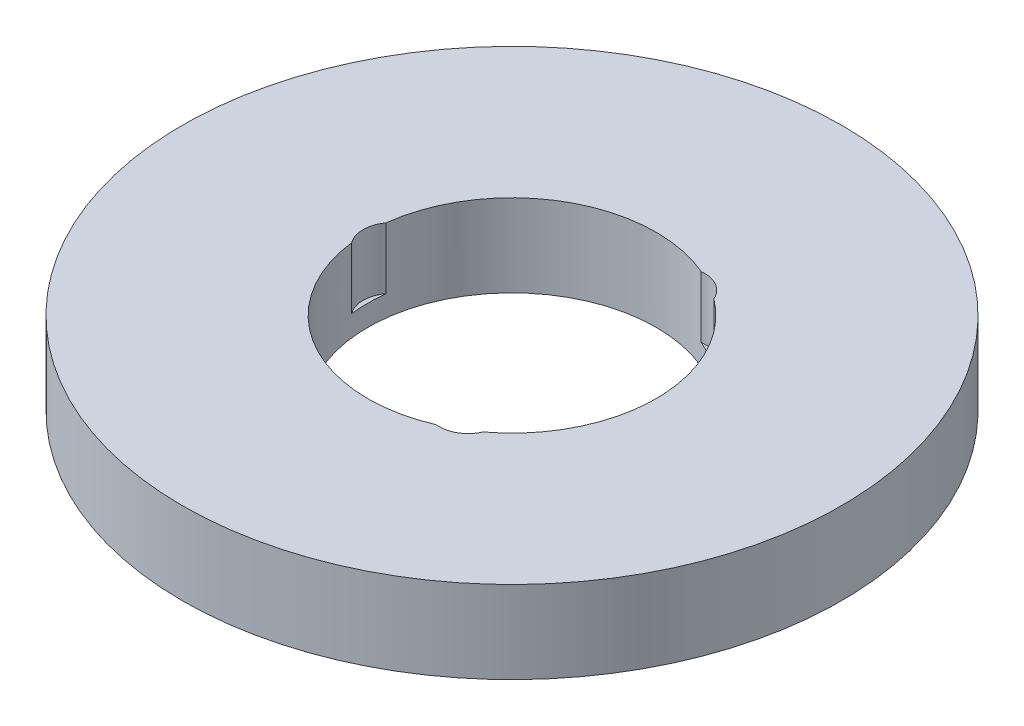
ISO-10303-21;
HEADER;
FILE_DESCRIPTION(('STEP AP214'),'2;1');
FILE_NAME('part.step','',(''),(''),'','','');
FILE_SCHEMA(('AUTOMOTIVE_DESIGN { 1 0 10303 214 1 1 1 1 }'));
ENDSEC;
DATA;
#1=APPLICATION_CONTEXT('core data for automotive mechanical design processes');
#2=APPLICATION_PROTOCOL_DEFINITION('international standard','automotive_design',2000,#1);
#3=PRODUCT_CONTEXT('',#1,'mechanical');
#4=PRODUCT('Part','Part','',(#3));
#5=PRODUCT_RELATED_PRODUCT_CATEGORY('part','',(#4));
#6=PRODUCT_DEFINITION_FORMATION('','',#4);
#7=PRODUCT_DEFINITION_CONTEXT('part definition',#1,'design');
#8=PRODUCT_DEFINITION('design','',#6,#7);
#9=PRODUCT_DEFINITION_SHAPE('','',#8);
#10=(LENGTH_UNIT() NAMED_UNIT(*) SI_UNIT(.MILLI.,.METRE.));
#11=(NAMED_UNIT(*) PLANE_ANGLE_UNIT() SI_UNIT($,.RADIAN.));
#12=(NAMED_UNIT(*) SI_UNIT($,.STERADIAN.) SOLID_ANGLE_UNIT());
#13=UNCERTAINTY_MEASURE_WITH_UNIT(LENGTH_MEASURE(1.E-05),#10,'distance_accuracy_value','');
#14=(GEOMETRIC_REPRESENTATION_CONTEXT(3) GLOBAL_UNCERTAINTY_ASSIGNED_CONTEXT((#13)) GLOBAL_UNIT_ASSIGNED_CONTEXT((#10,
#11,#12)) REPRESENTATION_CONTEXT('',''));
#15=CARTESIAN_POINT('',(0.,0.,0.));
#16=DIRECTION('',(0.,0.,1.));
#17=DIRECTION('',(1.,0.,0.));
#18=AXIS2_PLACEMENT_3D('',#15,#16,#17);
#19=CARTESIAN_POINT('',(0.,10.,0.));
#20=DIRECTION('',(0.,-1.,0.));
#21=DIRECTION('',(0.,0.,-1.));
#22=AXIS2_PLACEMENT_3D('',#19,#20,#21);
#23=CYLINDRICAL_SURFACE('',#22,40.);
#24=CARTESIAN_POINT('',(0.,10.,0.));
#25=DIRECTION('',(0.,1.,0.));
#26=DIRECTION('',(0.,0.,1.));
#27=AXIS2_PLACEMENT_3D('',#24,#25,#26);
#28=CIRCLE('',#27,40.);
#29=CARTESIAN_POINT('',(0.,10.,40.));
#30=VERTEX_POINT('',#29);
#31=EDGE_CURVE('E130',#30,#30,#28,.T.);
#32=ORIENTED_EDGE('',*,*,#31,.F.);
#33=EDGE_LOOP('',(#32));
#34=FACE_BOUND('',#33,.T.);
#35=CARTESIAN_POINT('',(0.,0.,0.));
#36=DIRECTION('',(0.,1.,0.));
#37=DIRECTION('',(0.,0.,1.));
#38=AXIS2_PLACEMENT_3D('',#35,#36,#37);
#39=CIRCLE('',#38,40.);
#40=CARTESIAN_POINT('',(0.,0.,40.));
#41=VERTEX_POINT('',#40);
#42=EDGE_CURVE('E117',#41,#41,#39,.T.);
#43=ORIENTED_EDGE('',*,*,#42,.T.);
#44=EDGE_LOOP('',(#43));
#45=FACE_BOUND('',#44,.T.);
#46=ADVANCED_FACE('F39',(#34,#45),#23,.T.);
#47=CARTESIAN_POINT('',(0.,10.,0.));
#48=DIRECTION('',(0.,1.,0.));
#49=DIRECTION('',(0.,0.,1.));
#50=AXIS2_PLACEMENT_3D('',#47,#48,#49);
#51=PLANE('',#50);
#52=CARTESIAN_POINT('',(7.26421371116821,10.,12.5819872247817));
#53=DIRECTION('',(0.,1.,0.));
#54=DIRECTION('',(0.866025403784436,0.,-0.500000000000004));
#55=AXIS2_PLACEMENT_3D('',#52,#53,#54);
#56=CIRCLE('',#55,3.53103083995547);
#57=CARTESIAN_POINT('',(6.87777020104384,10.,16.0918077623875));
#58=VERTEX_POINT('',#57);
#59=CARTESIAN_POINT('',(10.4970292145214,10.,14.0022275966892));
#60=VERTEX_POINT('',#59);
#61=EDGE_CURVE('E148',#58,#60,#56,.T.);
#62=ORIENTED_EDGE('',*,*,#61,.F.);
#63=CARTESIAN_POINT('',(0.,10.,0.));
#64=DIRECTION('',(0.,1.,0.));
#65=DIRECTION('',(0.,0.,1.));
#66=AXIS2_PLACEMENT_3D('',#63,#64,#65);
#67=CIRCLE('',#66,17.5);
#68=CARTESIAN_POINT('',(-17.3747994155651,10.,2.08958016569824));
#69=VERTEX_POINT('',#68);
#70=EDGE_CURVE('E113',#69,#58,#67,.T.);
#71=ORIENTED_EDGE('',*,*,#70,.F.);
#72=CARTESIAN_POINT('',(-14.5284274223363,10.,0.));
#73=DIRECTION('',(0.,1.,0.));
#74=DIRECTION('',(0.,0.,1.));
#75=AXIS2_PLACEMENT_3D('',#72,#73,#74);
#76=CIRCLE('',#75,3.53103083995547);
#77=CARTESIAN_POINT('',(-17.3747994155651,10.,-2.08958016569824));
#78=VERTEX_POINT('',#77);
#79=EDGE_CURVE('E125',#78,#69,#76,.T.);
#80=ORIENTED_EDGE('',*,*,#79,.F.);
#81=CARTESIAN_POINT('',(6.87777020104362,10.,-16.0918077623876));
#82=VERTEX_POINT('',#81);
#83=EDGE_CURVE('E107',#82,#78,#67,.T.);
#84=ORIENTED_EDGE('',*,*,#83,.F.);
#85=CARTESIAN_POINT('',(7.26421371116804,10.,-12.5819872247818));
#86=DIRECTION('',(0.,1.,0.));
#87=DIRECTION('',(-0.866025403784443,0.,-0.499999999999992));
#88=AXIS2_PLACEMENT_3D('',#85,#86,#87);
#89=CIRCLE('',#88,3.53103083995547);
#90=CARTESIAN_POINT('',(10.4970292145212,10.,-14.0022275966894));
#91=VERTEX_POINT('',#90);
#92=EDGE_CURVE('E95',#91,#82,#89,.T.);
#93=ORIENTED_EDGE('',*,*,#92,.F.);
#94=EDGE_CURVE('E106',#60,#91,#67,.T.);
#95=ORIENTED_EDGE('',*,*,#94,.F.);
#96=EDGE_LOOP('',(#62,#71,#80,#84,#93,#95));
#97=FACE_BOUND('',#96,.T.);
#98=ORIENTED_EDGE('',*,*,#31,.T.);
#99=EDGE_LOOP('',(#98));
#100=FACE_BOUND('',#99,.T.);
#101=ADVANCED_FACE('F102',(#97,#100),#51,.T.);
#102=CARTESIAN_POINT('',(0.,0.,0.));
#103=DIRECTION('',(0.,1.,0.));
#104=DIRECTION('',(0.,0.,1.));
#105=AXIS2_PLACEMENT_3D('',#102,#103,#104);
#106=PLANE('',#105);
#107=CARTESIAN_POINT('',(0.,0.,0.));
#108=DIRECTION('',(0.,1.,0.));
#109=DIRECTION('',(0.,0.,1.));
#110=AXIS2_PLACEMENT_3D('',#107,#108,#109);
#111=CIRCLE('',#110,17.5);
#112=CARTESIAN_POINT('',(0.,0.,17.5));
#113=VERTEX_POINT('',#112);
#114=EDGE_CURVE('E118',#113,#113,#111,.T.);
#115=ORIENTED_EDGE('',*,*,#114,.T.);
#116=EDGE_LOOP('',(#115));
#117=FACE_BOUND('',#116,.T.);
#118=ORIENTED_EDGE('',*,*,#42,.F.);
#119=EDGE_LOOP('',(#118));
#120=FACE_BOUND('',#119,.T.);
#121=ADVANCED_FACE('F161',(#117,#120),#106,.F.);
#122=CARTESIAN_POINT('',(0.,10.,0.));
#123=DIRECTION('',(0.,-1.,0.));
#124=DIRECTION('',(0.,0.,-1.));
#125=AXIS2_PLACEMENT_3D('',#122,#123,#124);
#126=CYLINDRICAL_SURFACE('',#125,17.5);
#127=DIRECTION('',(0.,1.,0.));
#128=VECTOR('',#127,1.);
#129=CARTESIAN_POINT('',(6.87777020104386,6.27701250615831,16.0918077623875));
#130=LINE('',#129,#128);
#131=CARTESIAN_POINT('',(6.87777020104384,2.55402501231662,16.0918077623875));
#132=VERTEX_POINT('',#131);
#133=EDGE_CURVE('E11',#132,#58,#130,.T.);
#134=ORIENTED_EDGE('',*,*,#133,.F.);
#135=CARTESIAN_POINT('',(0.,2.55402501231662,0.));
#136=DIRECTION('',(0.,1.,0.));
#137=DIRECTION('',(0.,0.,1.));
#138=AXIS2_PLACEMENT_3D('',#135,#136,#137);
#139=CIRCLE('',#138,17.5);
#140=CARTESIAN_POINT('',(10.4970292145214,2.55402501231662,14.0022275966892));
#141=VERTEX_POINT('',#140);
#142=EDGE_CURVE('E100',#132,#141,#139,.T.);
#143=ORIENTED_EDGE('',*,*,#142,.T.);
#144=DIRECTION('',(0.,1.,0.));
#145=VECTOR('',#144,1.);
#146=CARTESIAN_POINT('',(10.4970292145214,6.27701250615831,14.0022275966892));
#147=LINE('',#146,#145);
#148=EDGE_CURVE('E46',#60,#141,#147,.F.);
#149=ORIENTED_EDGE('',*,*,#148,.F.);
#150=ORIENTED_EDGE('',*,*,#94,.T.);
#151=DIRECTION('',(0.,1.,0.));
#152=VECTOR('',#151,1.);
#153=CARTESIAN_POINT('',(10.4970292145212,6.27701250615831,-14.0022275966894));
#154=LINE('',#153,#152);
#155=CARTESIAN_POINT('',(10.4970292145212,2.55402501231662,-14.0022275966894));
#156=VERTEX_POINT('',#155);
#157=EDGE_CURVE('E90',#156,#91,#154,.T.);
#158=ORIENTED_EDGE('',*,*,#157,.F.);
#159=CARTESIAN_POINT('',(0.,2.55402501231662,0.));
#160=DIRECTION('',(0.,1.,0.));
#161=DIRECTION('',(0.,0.,1.));
#162=AXIS2_PLACEMENT_3D('',#159,#160,#161);
#163=CIRCLE('',#162,17.5);
#164=CARTESIAN_POINT('',(6.87777020104362,2.55402501231662,-16.0918077623876));
#165=VERTEX_POINT('',#164);
#166=EDGE_CURVE('E143',#156,#165,#163,.T.);
#167=ORIENTED_EDGE('',*,*,#166,.T.);
#168=DIRECTION('',(0.,1.,0.));
#169=VECTOR('',#168,1.);
#170=CARTESIAN_POINT('',(6.87777020104363,6.27701250615831,-16.0918077623876));
#171=LINE('',#170,#169);
#172=EDGE_CURVE('E98',#82,#165,#171,.F.);
#173=ORIENTED_EDGE('',*,*,#172,.F.);
#174=ORIENTED_EDGE('',*,*,#83,.T.);
#175=DIRECTION('',(0.,1.,0.));
#176=VECTOR('',#175,1.);
#177=CARTESIAN_POINT('',(-17.3747994155651,6.27701250615831,-2.08958016569823));
#178=LINE('',#177,#176);
#179=CARTESIAN_POINT('',(-17.3747994155651,2.55402501231662,-2.08958016569824));
#180=VERTEX_POINT('',#179);
#181=EDGE_CURVE('E137',#180,#78,#178,.T.);
#182=ORIENTED_EDGE('',*,*,#181,.F.);
#183=CARTESIAN_POINT('',(0.,2.55402501231662,0.));
#184=DIRECTION('',(0.,1.,0.));
#185=DIRECTION('',(0.,0.,1.));
#186=AXIS2_PLACEMENT_3D('',#183,#184,#185);
#187=CIRCLE('',#186,17.5);
#188=CARTESIAN_POINT('',(-17.3747994155651,2.55402501231662,2.08958016569824));
#189=VERTEX_POINT('',#188);
#190=EDGE_CURVE('E128',#180,#189,#187,.T.);
#191=ORIENTED_EDGE('',*,*,#190,.T.);
#192=DIRECTION('',(0.,1.,0.));
#193=VECTOR('',#192,1.);
#194=CARTESIAN_POINT('',(-17.3747994155651,6.27701250615831,2.08958016569823));
#195=LINE('',#194,#193);
#196=EDGE_CURVE('E134',#69,#189,#195,.F.);
#197=ORIENTED_EDGE('',*,*,#196,.F.);
#198=ORIENTED_EDGE('',*,*,#70,.T.);
#199=EDGE_LOOP('',(#134,#143,#149,#150,#158,#167,#173,#174,#182,#191,#197,#198));
#200=FACE_BOUND('',#199,.T.);
#201=ORIENTED_EDGE('',*,*,#114,.F.);
#202=EDGE_LOOP('',(#201));
#203=FACE_BOUND('',#202,.T.);
#204=ADVANCED_FACE('F115',(#200,#203),#126,.F.);
#205=CARTESIAN_POINT('',(-14.5284274223363,2.55402501231662,0.));
#206=DIRECTION('',(0.,1.,0.));
#207=DIRECTION('',(0.,0.,1.));
#208=AXIS2_PLACEMENT_3D('',#205,#206,#207);
#209=CYLINDRICAL_SURFACE('',#208,3.53103083995547);
#210=ORIENTED_EDGE('',*,*,#181,.T.);
#211=ORIENTED_EDGE('',*,*,#79,.T.);
#212=ORIENTED_EDGE('',*,*,#196,.T.);
#213=CARTESIAN_POINT('',(-14.5284274223363,2.55402501231662,0.));
#214=DIRECTION('',(0.,1.,0.));
#215=DIRECTION('',(0.,0.,1.));
#216=AXIS2_PLACEMENT_3D('',#213,#214,#215);
#217=CIRCLE('',#216,3.53103083995547);
#218=EDGE_CURVE('E127',#180,#189,#217,.T.);
#219=ORIENTED_EDGE('',*,*,#218,.F.);
#220=EDGE_LOOP('',(#210,#211,#212,#219));
#221=FACE_BOUND('',#220,.T.);
#222=ADVANCED_FACE('F175',(#221),#209,.F.);
#223=CARTESIAN_POINT('',(-14.5284274223363,2.55402501231662,0.));
#224=DIRECTION('',(0.,1.,0.));
#225=DIRECTION('',(0.,0.,1.));
#226=AXIS2_PLACEMENT_3D('',#223,#224,#225);
#227=PLANE('',#226);
#228=ORIENTED_EDGE('',*,*,#218,.T.);
#229=ORIENTED_EDGE('',*,*,#190,.F.);
#230=EDGE_LOOP('',(#228,#229));
#231=FACE_BOUND('',#230,.T.);
#232=ADVANCED_FACE('F176',(#231),#227,.T.);
#233=CARTESIAN_POINT('',(7.26421371116804,2.55402501231662,-12.5819872247818));
#234=DIRECTION('',(0.,1.,0.));
#235=DIRECTION('',(0.,0.,1.));
#236=AXIS2_PLACEMENT_3D('',#233,#234,#235);
#237=CYLINDRICAL_SURFACE('',#236,3.53103083995547);
#238=ORIENTED_EDGE('',*,*,#157,.T.);
#239=ORIENTED_EDGE('',*,*,#92,.T.);
#240=ORIENTED_EDGE('',*,*,#172,.T.);
#241=CARTESIAN_POINT('',(7.26421371116804,2.55402501231662,-12.5819872247818));
#242=DIRECTION('',(0.,1.,0.));
#243=DIRECTION('',(-0.866025403784443,0.,-0.499999999999992));
#244=AXIS2_PLACEMENT_3D('',#241,#242,#243);
#245=CIRCLE('',#244,3.53103083995547);
#246=EDGE_CURVE('E56',#156,#165,#245,.T.);
#247=ORIENTED_EDGE('',*,*,#246,.F.);
#248=EDGE_LOOP('',(#238,#239,#240,#247));
#249=FACE_BOUND('',#248,.T.);
#250=ADVANCED_FACE('F93',(#249),#237,.F.);
#251=CARTESIAN_POINT('',(7.26421371116804,2.55402501231662,-12.5819872247818));
#252=DIRECTION('',(0.,1.,0.));
#253=DIRECTION('',(-0.866025403784443,0.,-0.499999999999992));
#254=AXIS2_PLACEMENT_3D('',#251,#252,#253);
#255=PLANE('',#254);
#256=ORIENTED_EDGE('',*,*,#246,.T.);
#257=ORIENTED_EDGE('',*,*,#166,.F.);
#258=EDGE_LOOP('',(#256,#257));
#259=FACE_BOUND('',#258,.T.);
#260=ADVANCED_FACE('F153',(#259),#255,.T.);
#261=CARTESIAN_POINT('',(7.26421371116821,2.55402501231662,12.5819872247817));
#262=DIRECTION('',(0.,1.,0.));
#263=DIRECTION('',(0.,0.,1.));
#264=AXIS2_PLACEMENT_3D('',#261,#262,#263);
#265=CYLINDRICAL_SURFACE('',#264,3.53103083995547);
#266=ORIENTED_EDGE('',*,*,#133,.T.);
#267=ORIENTED_EDGE('',*,*,#61,.T.);
#268=ORIENTED_EDGE('',*,*,#148,.T.);
#269=CARTESIAN_POINT('',(7.26421371116821,2.55402501231662,12.5819872247817));
#270=DIRECTION('',(0.,1.,0.));
#271=DIRECTION('',(0.866025403784436,0.,-0.500000000000004));
#272=AXIS2_PLACEMENT_3D('',#269,#270,#271);
#273=CIRCLE('',#272,3.53103083995547);
#274=EDGE_CURVE('E55',#132,#141,#273,.T.);
#275=ORIENTED_EDGE('',*,*,#274,.F.);
#276=EDGE_LOOP('',(#266,#267,#268,#275));
#277=FACE_BOUND('',#276,.T.);
#278=ADVANCED_FACE('F144',(#277),#265,.F.);
#279=CARTESIAN_POINT('',(7.26421371116821,2.55402501231662,12.5819872247817));
#280=DIRECTION('',(0.,1.,0.));
#281=DIRECTION('',(0.866025403784436,0.,-0.500000000000004));
#282=AXIS2_PLACEMENT_3D('',#279,#280,#281);
#283=PLANE('',#282);
#284=ORIENTED_EDGE('',*,*,#274,.T.);
#285=ORIENTED_EDGE('',*,*,#142,.F.);
#286=EDGE_LOOP('',(#284,#285));
#287=FACE_BOUND('',#286,.T.);
#288=ADVANCED_FACE('F150',(#287),#283,.T.);
#289=CLOSED_SHELL('',(#46,#101,#121,#204,#222,#232,#250,#260,#278,#288));
#290=MANIFOLD_SOLID_BREP('B2',#289);
#291=ADVANCED_BREP_SHAPE_REPRESENTATION('',(#18,#290),#14);
#292=SHAPE_DEFINITION_REPRESENTATION(#9,#291);
ENDSEC;
END-ISO-10303-21;
